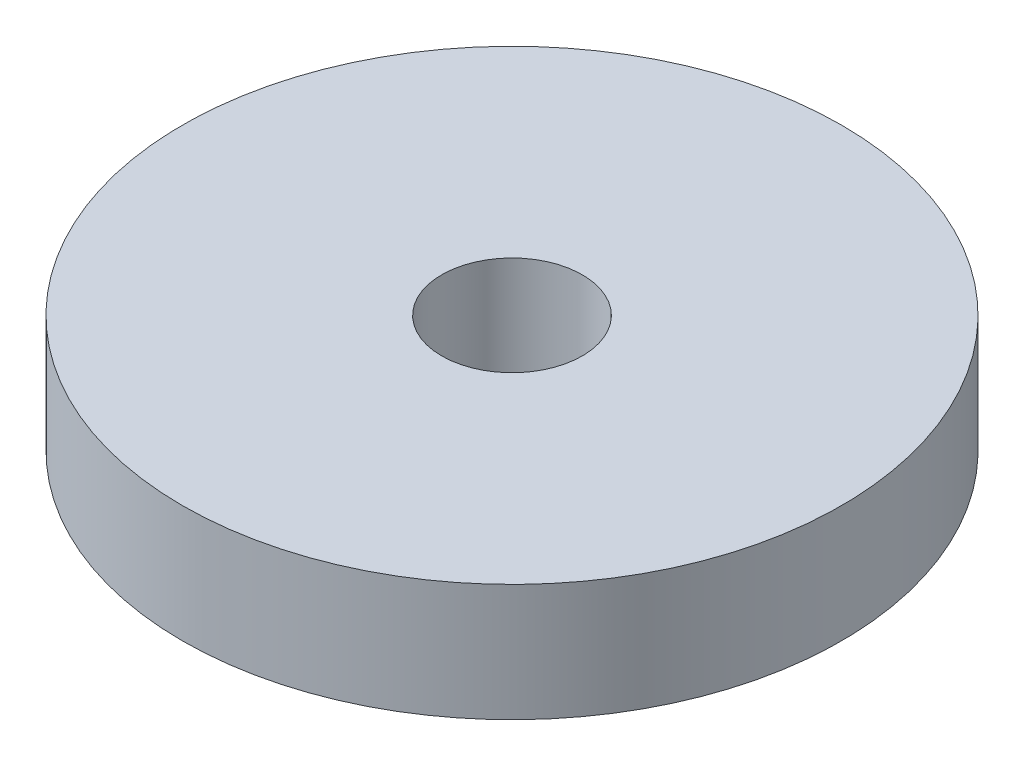
ISO-10303-21;
HEADER;
FILE_DESCRIPTION(('STEP AP214'),'2;1');
FILE_NAME('part.step','',(''),(''),'','','');
FILE_SCHEMA(('AUTOMOTIVE_DESIGN { 1 0 10303 214 1 1 1 1 }'));
ENDSEC;
DATA;
#1=APPLICATION_CONTEXT('core data for automotive mechanical design processes');
#2=APPLICATION_PROTOCOL_DEFINITION('international standard','automotive_design',2000,#1);
#3=PRODUCT_CONTEXT('',#1,'mechanical');
#4=PRODUCT('Part','Part','',(#3));
#5=PRODUCT_RELATED_PRODUCT_CATEGORY('part','',(#4));
#6=PRODUCT_DEFINITION_FORMATION('','',#4);
#7=PRODUCT_DEFINITION_CONTEXT('part definition',#1,'design');
#8=PRODUCT_DEFINITION('design','',#6,#7);
#9=PRODUCT_DEFINITION_SHAPE('','',#8);
#10=(LENGTH_UNIT() NAMED_UNIT(*) SI_UNIT(.MILLI.,.METRE.));
#11=(NAMED_UNIT(*) PLANE_ANGLE_UNIT() SI_UNIT($,.RADIAN.));
#12=(NAMED_UNIT(*) SI_UNIT($,.STERADIAN.) SOLID_ANGLE_UNIT());
#13=UNCERTAINTY_MEASURE_WITH_UNIT(LENGTH_MEASURE(1.E-05),#10,'distance_accuracy_value','');
#14=(GEOMETRIC_REPRESENTATION_CONTEXT(3) GLOBAL_UNCERTAINTY_ASSIGNED_CONTEXT((#13)) GLOBAL_UNIT_ASSIGNED_CONTEXT((#10,
#11,#12)) REPRESENTATION_CONTEXT('',''));
#15=CARTESIAN_POINT('',(0.,0.,0.));
#16=DIRECTION('',(0.,0.,1.));
#17=DIRECTION('',(1.,0.,0.));
#18=AXIS2_PLACEMENT_3D('',#15,#16,#17);
#19=CARTESIAN_POINT('',(0.,3.175,0.));
#20=DIRECTION('',(0.,-1.,0.));
#21=DIRECTION('',(0.,0.,-1.));
#22=AXIS2_PLACEMENT_3D('',#19,#20,#21);
#23=CYLINDRICAL_SURFACE('',#22,8.92937);
#24=CARTESIAN_POINT('',(0.,3.175,0.));
#25=DIRECTION('',(0.,1.,0.));
#26=DIRECTION('',(0.,0.,1.));
#27=AXIS2_PLACEMENT_3D('',#24,#25,#26);
#28=CIRCLE('',#27,8.92937);
#29=CARTESIAN_POINT('',(0.,3.175,8.92937));
#30=VERTEX_POINT('',#29);
#31=EDGE_CURVE('E10',#30,#30,#28,.T.);
#32=ORIENTED_EDGE('',*,*,#31,.F.);
#33=EDGE_LOOP('',(#32));
#34=FACE_BOUND('',#33,.T.);
#35=CARTESIAN_POINT('',(0.,0.,0.));
#36=DIRECTION('',(0.,1.,0.));
#37=DIRECTION('',(0.,0.,1.));
#38=AXIS2_PLACEMENT_3D('',#35,#36,#37);
#39=CIRCLE('',#38,8.92937);
#40=CARTESIAN_POINT('',(0.,0.,8.92937));
#41=VERTEX_POINT('',#40);
#42=EDGE_CURVE('E40',#41,#41,#39,.T.);
#43=ORIENTED_EDGE('',*,*,#42,.T.);
#44=EDGE_LOOP('',(#43));
#45=FACE_BOUND('',#44,.T.);
#46=ADVANCED_FACE('F37',(#34,#45),#23,.T.);
#47=CARTESIAN_POINT('',(0.,3.175,0.));
#48=DIRECTION('',(0.,1.,0.));
#49=DIRECTION('',(0.,0.,1.));
#50=AXIS2_PLACEMENT_3D('',#47,#48,#49);
#51=PLANE('',#50);
#52=CARTESIAN_POINT('',(0.,3.175,0.));
#53=DIRECTION('',(0.,1.,0.));
#54=DIRECTION('',(0.,0.,1.));
#55=AXIS2_PLACEMENT_3D('',#52,#53,#54);
#56=CIRCLE('',#55,1.905);
#57=CARTESIAN_POINT('',(0.,3.175,1.905));
#58=VERTEX_POINT('',#57);
#59=EDGE_CURVE('E49',#58,#58,#56,.T.);
#60=ORIENTED_EDGE('',*,*,#59,.F.);
#61=EDGE_LOOP('',(#60));
#62=FACE_BOUND('',#61,.T.);
#63=ORIENTED_EDGE('',*,*,#31,.T.);
#64=EDGE_LOOP('',(#63));
#65=FACE_BOUND('',#64,.T.);
#66=ADVANCED_FACE('F64',(#62,#65),#51,.T.);
#67=CARTESIAN_POINT('',(0.,0.,0.));
#68=DIRECTION('',(0.,1.,0.));
#69=DIRECTION('',(0.,0.,1.));
#70=AXIS2_PLACEMENT_3D('',#67,#68,#69);
#71=PLANE('',#70);
#72=CARTESIAN_POINT('',(0.,0.,0.));
#73=DIRECTION('',(0.,1.,0.));
#74=DIRECTION('',(0.,0.,1.));
#75=AXIS2_PLACEMENT_3D('',#72,#73,#74);
#76=CIRCLE('',#75,1.905);
#77=CARTESIAN_POINT('',(0.,0.,1.905));
#78=VERTEX_POINT('',#77);
#79=EDGE_CURVE('E47',#78,#78,#76,.T.);
#80=ORIENTED_EDGE('',*,*,#79,.T.);
#81=EDGE_LOOP('',(#80));
#82=FACE_BOUND('',#81,.T.);
#83=ORIENTED_EDGE('',*,*,#42,.F.);
#84=EDGE_LOOP('',(#83));
#85=FACE_BOUND('',#84,.T.);
#86=ADVANCED_FACE('F55',(#82,#85),#71,.F.);
#87=CARTESIAN_POINT('',(0.,0.,0.));
#88=DIRECTION('',(0.,1.,0.));
#89=DIRECTION('',(0.,0.,1.));
#90=AXIS2_PLACEMENT_3D('',#87,#88,#89);
#91=CYLINDRICAL_SURFACE('',#90,1.905);
#92=ORIENTED_EDGE('',*,*,#79,.F.);
#93=EDGE_LOOP('',(#92));
#94=FACE_BOUND('',#93,.T.);
#95=ORIENTED_EDGE('',*,*,#59,.T.);
#96=EDGE_LOOP('',(#95));
#97=FACE_BOUND('',#96,.T.);
#98=ADVANCED_FACE('F58',(#94,#97),#91,.F.);
#99=CLOSED_SHELL('',(#46,#66,#86,#98));
#100=MANIFOLD_SOLID_BREP('B2',#99);
#101=ADVANCED_BREP_SHAPE_REPRESENTATION('',(#18,#100),#14);
#102=SHAPE_DEFINITION_REPRESENTATION(#9,#101);
ENDSEC;
END-ISO-10303-21;
